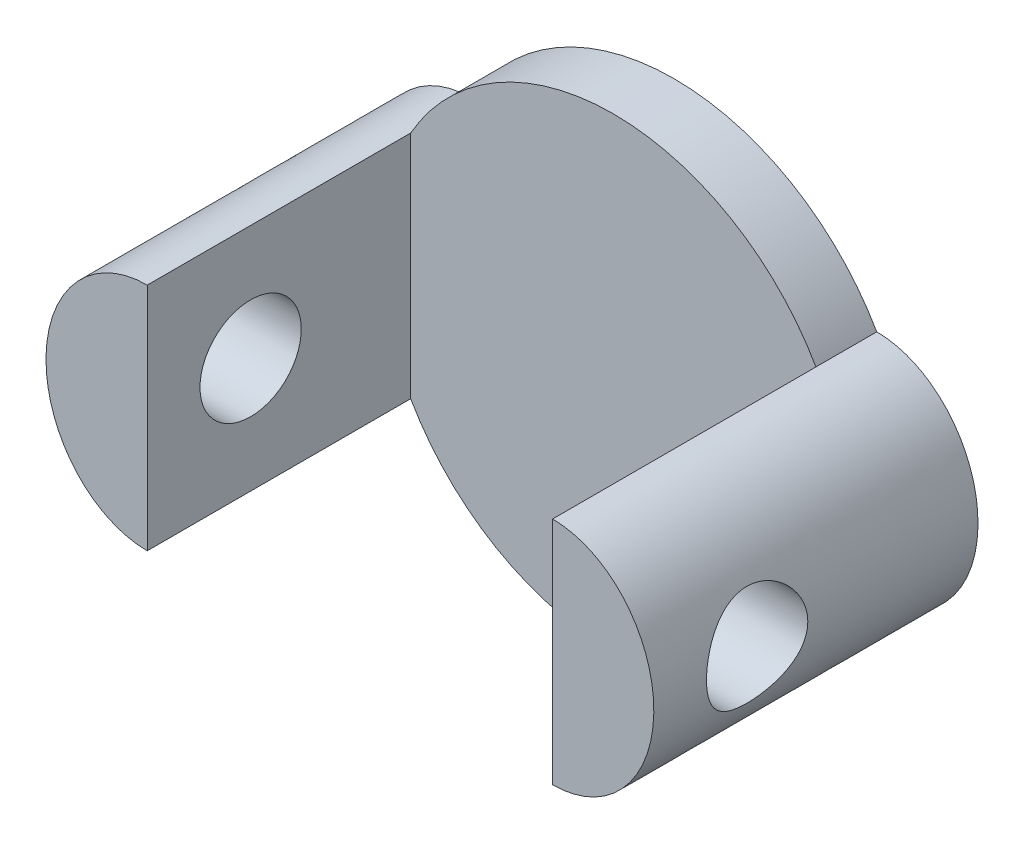
ISO-10303-21;
HEADER;
FILE_DESCRIPTION(('STEP AP214'),'2;1');
FILE_NAME('part.step','',(''),(''),'','','');
FILE_SCHEMA(('AUTOMOTIVE_DESIGN { 1 0 10303 214 1 1 1 1 }'));
ENDSEC;
DATA;
#1=APPLICATION_CONTEXT('core data for automotive mechanical design processes');
#2=APPLICATION_PROTOCOL_DEFINITION('international standard','automotive_design',2000,#1);
#3=PRODUCT_CONTEXT('',#1,'mechanical');
#4=PRODUCT('Part','Part','',(#3));
#5=PRODUCT_RELATED_PRODUCT_CATEGORY('part','',(#4));
#6=PRODUCT_DEFINITION_FORMATION('','',#4);
#7=PRODUCT_DEFINITION_CONTEXT('part definition',#1,'design');
#8=PRODUCT_DEFINITION('design','',#6,#7);
#9=PRODUCT_DEFINITION_SHAPE('','',#8);
#10=(LENGTH_UNIT() NAMED_UNIT(*) SI_UNIT(.MILLI.,.METRE.));
#11=(NAMED_UNIT(*) PLANE_ANGLE_UNIT() SI_UNIT($,.RADIAN.));
#12=(NAMED_UNIT(*) SI_UNIT($,.STERADIAN.) SOLID_ANGLE_UNIT());
#13=UNCERTAINTY_MEASURE_WITH_UNIT(LENGTH_MEASURE(1.E-05),#10,'distance_accuracy_value','');
#14=(GEOMETRIC_REPRESENTATION_CONTEXT(3) GLOBAL_UNCERTAINTY_ASSIGNED_CONTEXT((#13)) GLOBAL_UNIT_ASSIGNED_CONTEXT((#10,
#11,#12)) REPRESENTATION_CONTEXT('',''));
#15=CARTESIAN_POINT('',(0.,0.,0.));
#16=DIRECTION('',(0.,0.,1.));
#17=DIRECTION('',(1.,0.,0.));
#18=AXIS2_PLACEMENT_3D('',#15,#16,#17);
#19=CARTESIAN_POINT('',(0.,0.,160.));
#20=DIRECTION('',(0.,0.,-1.));
#21=DIRECTION('',(-1.,0.,0.));
#22=AXIS2_PLACEMENT_3D('',#19,#20,#21);
#23=CYLINDRICAL_SURFACE('',#22,115.);
#24=CARTESIAN_POINT('',(0.,0.,30.));
#25=DIRECTION('',(0.,0.,1.));
#26=DIRECTION('',(1.,0.,0.));
#27=AXIS2_PLACEMENT_3D('',#24,#25,#26);
#28=CIRCLE('',#27,115.);
#29=CARTESIAN_POINT('',(99.9999999999997,56.789083458004,30.));
#30=VERTEX_POINT('',#29);
#31=CARTESIAN_POINT('',(-100.,56.7890834580027,30.));
#32=VERTEX_POINT('',#31);
#33=EDGE_CURVE('E209',#30,#32,#28,.T.);
#34=ORIENTED_EDGE('',*,*,#33,.F.);
#35=DIRECTION('',(0.,0.,-1.));
#36=VECTOR('',#35,1.);
#37=CARTESIAN_POINT('',(99.9999999999997,56.789083458004,160.));
#38=LINE('',#37,#36);
#39=CARTESIAN_POINT('',(99.9999999999997,56.789083458004,0.));
#40=VERTEX_POINT('',#39);
#41=EDGE_CURVE('E126',#30,#40,#38,.T.);
#42=ORIENTED_EDGE('',*,*,#41,.T.);
#43=CARTESIAN_POINT('',(0.,0.,0.));
#44=DIRECTION('',(0.,0.,1.));
#45=DIRECTION('',(1.,0.,0.));
#46=AXIS2_PLACEMENT_3D('',#43,#44,#45);
#47=CIRCLE('',#46,115.);
#48=CARTESIAN_POINT('',(-100.,56.7890834580029,0.));
#49=VERTEX_POINT('',#48);
#50=EDGE_CURVE('E105',#40,#49,#47,.T.);
#51=ORIENTED_EDGE('',*,*,#50,.T.);
#52=DIRECTION('',(0.,0.,-1.));
#53=VECTOR('',#52,1.);
#54=CARTESIAN_POINT('',(-100.,56.7890834580029,160.));
#55=LINE('',#54,#53);
#56=EDGE_CURVE('E100',#32,#49,#55,.T.);
#57=ORIENTED_EDGE('',*,*,#56,.F.);
#58=EDGE_LOOP('',(#34,#42,#51,#57));
#59=FACE_BOUND('',#58,.T.);
#60=ADVANCED_FACE('F45',(#59),#23,.T.);
#61=CARTESIAN_POINT('',(0.,0.,160.));
#62=DIRECTION('',(0.,0.,-1.));
#63=DIRECTION('',(-1.,0.,0.));
#64=AXIS2_PLACEMENT_3D('',#61,#62,#63);
#65=CYLINDRICAL_SURFACE('',#64,115.);
#66=CARTESIAN_POINT('',(0.,0.,30.));
#67=DIRECTION('',(0.,0.,1.));
#68=DIRECTION('',(1.,0.,0.));
#69=AXIS2_PLACEMENT_3D('',#66,#67,#68);
#70=CIRCLE('',#69,115.);
#71=CARTESIAN_POINT('',(-100.,-56.7890834580029,30.));
#72=VERTEX_POINT('',#71);
#73=CARTESIAN_POINT('',(99.9999999999997,-56.7890834580039,30.));
#74=VERTEX_POINT('',#73);
#75=EDGE_CURVE('E11',#72,#74,#70,.T.);
#76=ORIENTED_EDGE('',*,*,#75,.F.);
#77=DIRECTION('',(0.,0.,-1.));
#78=VECTOR('',#77,1.);
#79=CARTESIAN_POINT('',(-100.,-56.7890834580027,160.));
#80=LINE('',#79,#78);
#81=CARTESIAN_POINT('',(-100.,-56.7890834580027,0.));
#82=VERTEX_POINT('',#81);
#83=EDGE_CURVE('E83',#72,#82,#80,.T.);
#84=ORIENTED_EDGE('',*,*,#83,.T.);
#85=CARTESIAN_POINT('',(0.,0.,0.));
#86=DIRECTION('',(0.,0.,1.));
#87=DIRECTION('',(1.,0.,0.));
#88=AXIS2_PLACEMENT_3D('',#85,#86,#87);
#89=CIRCLE('',#88,115.);
#90=CARTESIAN_POINT('',(100.000000000001,-56.7890834580012,0.));
#91=VERTEX_POINT('',#90);
#92=EDGE_CURVE('E88',#82,#91,#89,.T.);
#93=ORIENTED_EDGE('',*,*,#92,.T.);
#94=DIRECTION('',(0.,0.,-1.));
#95=VECTOR('',#94,1.);
#96=CARTESIAN_POINT('',(100.000000000001,-56.7890834580012,160.));
#97=LINE('',#96,#95);
#98=EDGE_CURVE('E119',#74,#91,#97,.T.);
#99=ORIENTED_EDGE('',*,*,#98,.F.);
#100=EDGE_LOOP('',(#76,#84,#93,#99));
#101=FACE_BOUND('',#100,.T.);
#102=ADVANCED_FACE('F85',(#101),#65,.T.);
#103=CARTESIAN_POINT('',(100.000000000001,1.38777878078145E-12,160.));
#104=DIRECTION('',(0.,0.,-1.));
#105=DIRECTION('',(-1.,0.,0.));
#106=AXIS2_PLACEMENT_3D('',#103,#104,#105);
#107=PLANE('',#106);
#108=CARTESIAN_POINT('',(-100.,0.,160.));
#109=DIRECTION('',(0.,0.,1.));
#110=DIRECTION('',(0.,1.,0.));
#111=AXIS2_PLACEMENT_3D('',#108,#109,#110);
#112=ELLIPSE('',#111,56.7890834580027,50.);
#113=CARTESIAN_POINT('',(-100.,56.7890834580027,160.));
#114=VERTEX_POINT('',#113);
#115=CARTESIAN_POINT('',(-100.,-56.7890834580029,160.));
#116=VERTEX_POINT('',#115);
#117=EDGE_CURVE('E115',#114,#116,#112,.T.);
#118=ORIENTED_EDGE('',*,*,#117,.T.);
#119=DIRECTION('',(0.,1.,0.));
#120=VECTOR('',#119,1.);
#121=CARTESIAN_POINT('',(-100.,1.35409814467722E-12,160.));
#122=LINE('',#121,#120);
#123=EDGE_CURVE('E58',#116,#114,#122,.T.);
#124=ORIENTED_EDGE('',*,*,#123,.T.);
#125=EDGE_LOOP('',(#118,#124));
#126=FACE_BOUND('',#125,.T.);
#127=ADVANCED_FACE('F141',(#126),#107,.F.);
#128=CARTESIAN_POINT('',(100.000000000001,1.38777878078145E-12,160.));
#129=DIRECTION('',(0.,0.,1.));
#130=DIRECTION('',(0.,1.,0.));
#131=AXIS2_PLACEMENT_3D('',#128,#129,#130);
#132=ELLIPSE('',#131,56.7890834580027,50.);
#133=DIRECTION('',(0.,0.,-1.));
#134=VECTOR('',#133,1.);
#135=SURFACE_OF_LINEAR_EXTRUSION('',#132,#134);
#136=CARTESIAN_POINT('',(144.894363521149,25.,109.));
#137=CARTESIAN_POINT('',(144.894368556172,24.9999950347854,108.329231197904));
#138=CARTESIAN_POINT('',(144.906057373851,24.9729668299235,107.658240525224));
#139=CARTESIAN_POINT('',(144.952426065453,24.8651140989651,106.321101595667));
#140=CARTESIAN_POINT('',(144.987120453288,24.7842556119221,105.654956664293));
#141=CARTESIAN_POINT('',(145.078409591069,24.5693499723057,104.33120418165));
#142=CARTESIAN_POINT('',(145.135055499316,24.4351785545981,103.673620309788));
#143=CARTESIAN_POINT('',(145.268321221031,24.1150637319087,102.373389524043));
#144=CARTESIAN_POINT('',(145.344938045947,23.9291280729128,101.730740390905));
#145=CARTESIAN_POINT('',(145.515356580168,23.5080393304398,100.466881471337));
#146=CARTESIAN_POINT('',(145.609092606083,23.2730738905481,99.8456001724598));
#147=CARTESIAN_POINT('',(145.811103575888,22.7554886741812,98.625666427075));
#148=CARTESIAN_POINT('',(145.919379029678,22.4728672263112,98.0270147751372));
#149=CARTESIAN_POINT('',(146.14732647972,21.8622321906428,96.8559144828546));
#150=CARTESIAN_POINT('',(146.266994534747,21.534234282975,96.2834568815306));
#151=CARTESIAN_POINT('',(146.514553173208,20.8349040416154,95.1674166239178));
#152=CARTESIAN_POINT('',(146.642444204257,20.4635693479937,94.6238355424644));
#153=CARTESIAN_POINT('',(146.84128977608,19.8658298939089,93.8188201238916));
#154=CARTESIAN_POINT('',(146.910480302842,19.6542158712316,93.5458426383577));
#155=CARTESIAN_POINT('',(147.049731523938,19.2200350613653,93.009084386135));
#156=CARTESIAN_POINT('',(147.119792009563,18.9974708646309,92.7453014692978));
#157=CARTESIAN_POINT('',(147.330611220712,18.3137162862773,91.9681512907157));
#158=CARTESIAN_POINT('',(147.472015726562,17.8364400427016,91.4689504628656));
#159=CARTESIAN_POINT('',(147.752802420339,16.8418221904528,90.5113586915465));
#160=CARTESIAN_POINT('',(147.892183956519,16.324467995616,90.052980666098));
#161=CARTESIAN_POINT('',(148.165314185362,15.2526533967951,89.1799533555816));
#162=CARTESIAN_POINT('',(148.29906280386,14.6981925045056,88.7653046461544));
#163=CARTESIAN_POINT('',(148.562263448946,13.5342383382462,87.9681168881713));
#164=CARTESIAN_POINT('',(148.69137546775,12.9234699777699,87.5873243987379));
#165=CARTESIAN_POINT('',(148.936284340394,11.6692861120943,86.8788227060358));
#166=CARTESIAN_POINT('',(149.052080768537,11.0258695640871,86.5511151997452));
#167=CARTESIAN_POINT('',(149.267064757994,9.71095405139172,85.9518063621348));
#168=CARTESIAN_POINT('',(149.366257276167,9.03946354286427,85.6801882804459));
#169=CARTESIAN_POINT('',(149.545218486804,7.67312905983944,85.1956220871929));
#170=CARTESIAN_POINT('',(149.624988354256,6.97828650093734,84.9826704264575));
#171=CARTESIAN_POINT('',(149.759530719128,5.60370474194978,84.6262698939044));
#172=CARTESIAN_POINT('',(149.815300458868,4.92478651575991,84.480028823639));
#173=CARTESIAN_POINT('',(149.905552168596,3.55575008993984,84.2444143668963));
#174=CARTESIAN_POINT('',(149.940034747544,2.86563221127669,84.155039353655));
#175=CARTESIAN_POINT('',(149.986749327729,1.47980142410124,84.0341464936305));
#176=CARTESIAN_POINT('',(149.99898790908,0.784090231362905,84.0026115368542));
#177=CARTESIAN_POINT('',(150.000891301508,-0.607557928949882,83.9977001006275));
#178=CARTESIAN_POINT('',(149.990556840115,-1.30349488852504,84.0243217467857));
#179=CARTESIAN_POINT('',(149.948737937048,-2.65358808368269,84.1324959696746));
#180=CARTESIAN_POINT('',(149.918392638926,-3.30801922950008,84.2110905561345));
#181=CARTESIAN_POINT('',(149.838463407718,-4.60746410896543,84.4194338185319));
#182=CARTESIAN_POINT('',(149.788880277919,-5.25247823465947,84.5491803585955));
#183=CARTESIAN_POINT('',(149.67169132969,-6.52874229560619,84.8586099487053));
#184=CARTESIAN_POINT('',(149.604084982378,-7.15999182635598,85.0382944641617));
#185=CARTESIAN_POINT('',(149.452479634725,-8.4046520203995,85.4460043211301));
#186=CARTESIAN_POINT('',(149.368480197689,-9.01806220797141,85.6740309504398));
#187=CARTESIAN_POINT('',(149.184766402354,-10.2319341888613,86.1801379678215));
#188=CARTESIAN_POINT('',(149.084844449865,-10.8320852742545,86.4588876519898));
#189=CARTESIAN_POINT('',(148.872552983732,-12.0066820210371,87.0620081705216));
#190=CARTESIAN_POINT('',(148.760183434398,-12.5811276087114,87.386379135701));
#191=CARTESIAN_POINT('',(148.525589629462,-13.7013205956684,88.0785422067058));
#192=CARTESIAN_POINT('',(148.403362793114,-14.2470604172683,88.4463456954259));
#193=CARTESIAN_POINT('',(148.151909664892,-15.3068289229021,89.2229262566299));
#194=CARTESIAN_POINT('',(148.022683092269,-15.8208563332294,89.6317049731263));
#195=CARTESIAN_POINT('',(147.75205629676,-16.8454583033008,90.5144508274207));
#196=CARTESIAN_POINT('',(147.610397867403,-17.3538461340511,90.9908875952597));
#197=CARTESIAN_POINT('',(147.397346670347,-18.0850793688688,91.7358442880612));
#198=CARTESIAN_POINT('',(147.326231250762,-18.3236128511314,91.9892300986436));
#199=CARTESIAN_POINT('',(147.184258022777,-18.7899960852633,92.5058444169005));
#200=CARTESIAN_POINT('',(147.113400283735,-19.0178431324434,92.7690753863629));
#201=CARTESIAN_POINT('',(146.901941355322,-19.6848030109755,93.572966198372));
#202=CARTESIAN_POINT('',(146.762453969659,-20.1073362264721,94.1278256227224));
#203=CARTESIAN_POINT('',(146.49041563923,-20.9052713419556,95.2720691250259));
#204=CARTESIAN_POINT('',(146.357864537178,-21.2806743109369,95.8614524194738));
#205=CARTESIAN_POINT('',(146.165434209211,-21.8112102370442,96.7770635000922));
#206=CARTESIAN_POINT('',(146.101552330749,-21.984705555232,97.0919316621116));
#207=CARTESIAN_POINT('',(145.977177356129,-22.3181693587649,97.7293005890983));
#208=CARTESIAN_POINT('',(145.916683448837,-22.4781410865842,98.0517995006144));
#209=CARTESIAN_POINT('',(145.741015203128,-22.9373354394864,99.0301698514212));
#210=CARTESIAN_POINT('',(145.63164231665,-23.2158700010922,99.6969714160684));
#211=CARTESIAN_POINT('',(145.432341338689,-23.7147451256155,101.054336928578));
#212=CARTESIAN_POINT('',(145.342402990474,-23.9351163983323,101.744888118224));
#213=CARTESIAN_POINT('',(145.185232071654,-24.3155209469368,103.144963301135));
#214=CARTESIAN_POINT('',(145.117997722655,-24.4755589488199,103.854485803684));
#215=CARTESIAN_POINT('',(145.012110245192,-24.7257333871125,105.244127308767));
#216=CARTESIAN_POINT('',(144.971997306614,-24.8194556062135,105.923491259489));
#217=CARTESIAN_POINT('',(144.915632820245,-24.9507764182586,107.2886068789));
#218=CARTESIAN_POINT('',(144.899380318599,-24.9883772547336,107.974358291139));
#219=CARTESIAN_POINT('',(144.891337193415,-25.0070114605971,109.346592947165));
#220=CARTESIAN_POINT('',(144.899540321217,-24.9880592798481,110.033075959216));
#221=CARTESIAN_POINT('',(144.940092212524,-24.8938427478276,111.401432754232));
#222=CARTESIAN_POINT('',(144.972440395832,-24.8185797496824,112.083306647555));
#223=CARTESIAN_POINT('',(145.05764965882,-24.6183697553633,113.399304697292));
#224=CARTESIAN_POINT('',(145.109265625215,-24.4964289217547,114.033970445812));
#225=CARTESIAN_POINT('',(145.231334926612,-24.2043195387485,115.290211616834));
#226=CARTESIAN_POINT('',(145.301787414782,-24.0341531573996,115.911787626455));
#227=CARTESIAN_POINT('',(145.45941990782,-23.6470820035451,117.138123122461));
#228=CARTESIAN_POINT('',(145.546602764242,-23.4301692627293,117.742879721968));
#229=CARTESIAN_POINT('',(145.735191820885,-22.9513769678846,118.932027754678));
#230=CARTESIAN_POINT('',(145.83659865169,-22.6894954201643,119.51641828357));
#231=CARTESIAN_POINT('',(146.055306582142,-22.1109784520989,120.685343701651));
#232=CARTESIAN_POINT('',(146.173090623464,-21.7925306888978,121.268891105897));
#233=CARTESIAN_POINT('',(146.417831185053,-21.1111794800121,122.407394718633));
#234=CARTESIAN_POINT('',(146.544787877242,-20.7482752009916,122.962350390895));
#235=CARTESIAN_POINT('',(146.80457242708,-19.9801797256228,124.040976304064));
#236=CARTESIAN_POINT('',(146.937402220097,-19.5749745290451,124.564636096305));
#237=CARTESIAN_POINT('',(147.20557551058,-18.724616457988,125.577879832282));
#238=CARTESIAN_POINT('',(147.340919099101,-18.2794621342127,126.067462538606));
#239=CARTESIAN_POINT('',(147.548149309578,-17.5670825378241,126.791098749934));
#240=CARTESIAN_POINT('',(147.620335094868,-17.3131605944574,127.038293615381));
#241=CARTESIAN_POINT('',(147.763970550649,-16.794993344307,127.521709597034));
#242=CARTESIAN_POINT('',(147.835420383245,-16.5307503751366,127.757933171902));
#243=CARTESIAN_POINT('',(148.047976295613,-15.7229546917371,128.44971016741));
#244=CARTESIAN_POINT('',(148.18729704887,-15.1643071048573,128.888398400518));
#245=CARTESIAN_POINT('',(148.457336872933,-14.0103566811006,129.717500099457));
#246=CARTESIAN_POINT('',(148.58805551251,-13.4150520094718,130.107911145982));
#247=CARTESIAN_POINT('',(148.837368290663,-12.1913918639603,130.837519718806));
#248=CARTESIAN_POINT('',(148.955962722369,-11.5630371896927,131.176718483372));
#249=CARTESIAN_POINT('',(149.177482027536,-10.2790520163404,131.800199403595));
#250=CARTESIAN_POINT('',(149.280446968015,-9.62349694158629,132.084622500957));
#251=CARTESIAN_POINT('',(149.468211960496,-8.28812063386326,132.597000819472));
#252=CARTESIAN_POINT('',(149.553011891152,-7.6082992388231,132.824955663401));
#253=CARTESIAN_POINT('',(149.701997133249,-6.22975361962117,133.221982773767));
#254=CARTESIAN_POINT('',(149.766190921207,-5.53103729662955,133.391079254523));
#255=CARTESIAN_POINT('',(149.872137437533,-4.12000115724839,133.668654303384));
#256=CARTESIAN_POINT('',(149.91389156756,-3.40768219340584,133.777136657673));
#257=CARTESIAN_POINT('',(149.971871381844,-2.01986689176782,133.927427541913));
#258=CARTESIAN_POINT('',(149.989521252703,-1.34483058657404,133.972957879292));
#259=CARTESIAN_POINT('',(150.003540479809,0.00691769003103627,134.009138806279));
#260=CARTESIAN_POINT('',(149.999910771684,0.683629586461526,133.999791808756));
#261=CARTESIAN_POINT('',(149.97146910118,2.03352630633315,133.92632424142));
#262=CARTESIAN_POINT('',(149.946659929413,2.70671158268598,133.862210887635));
#263=CARTESIAN_POINT('',(149.876514994706,4.04462421179346,133.679887018996));
#264=CARTESIAN_POINT('',(149.831179284175,4.70935158613869,133.561676642265));
#265=CARTESIAN_POINT('',(149.722688041088,6.00726200992695,133.276367337055));
#266=CARTESIAN_POINT('',(149.660061788486,6.64080856730083,133.110715736884));
#267=CARTESIAN_POINT('',(149.518033552974,7.89122404098399,132.730898243747));
#268=CARTESIAN_POINT('',(149.438632002327,8.50809338656703,132.516733600846));
#269=CARTESIAN_POINT('',(149.264916017883,9.72145390959457,132.041655604414));
#270=CARTESIAN_POINT('',(149.170599787055,10.3179426208836,131.780736617067));
#271=CARTESIAN_POINT('',(148.969239827072,11.4870505198662,131.21417725256));
#272=CARTESIAN_POINT('',(148.862195623342,12.0596688164539,130.908535207762));
#273=CARTESIAN_POINT('',(148.633082870686,13.2014821532325,130.240914317686));
#274=CARTESIAN_POINT('',(148.510571577564,13.7695186281451,129.87710569365));
#275=CARTESIAN_POINT('',(148.25734156834,14.873151833139,129.10578621076));
#276=CARTESIAN_POINT('',(148.126622654538,15.4087477812058,128.698274299047));
#277=CARTESIAN_POINT('',(147.860125023405,16.4446995767134,127.842066792108));
#278=CARTESIAN_POINT('',(147.72434569208,16.945051126432,127.39336618962));
#279=CARTESIAN_POINT('',(147.450988690736,17.908010224188,126.457214204794));
#280=CARTESIAN_POINT('',(147.313410204171,18.3705998917857,125.969744678387));
#281=CARTESIAN_POINT('',(147.031923200394,19.281181720004,124.929265697499));
#282=CARTESIAN_POINT('',(146.888115654768,19.7267336609006,124.374090008836));
#283=CARTESIAN_POINT('',(146.606591438621,20.5693489242304,123.227020247196));
#284=CARTESIAN_POINT('',(146.468872106163,20.9664335743592,122.635142498877));
#285=CARTESIAN_POINT('',(146.203544478168,21.7096948090885,121.417651330299));
#286=CARTESIAN_POINT('',(146.075941144443,22.0558464818804,120.79202160472));
#287=CARTESIAN_POINT('',(145.835015368715,22.6941829477941,119.5112262771));
#288=CARTESIAN_POINT('',(145.721690961253,22.986375170889,118.856064756933));
#289=CARTESIAN_POINT('',(145.522343612803,23.4909245029176,117.579352189304));
#290=CARTESIAN_POINT('',(145.434795590667,23.7080448917775,116.959918505523));
#291=CARTESIAN_POINT('',(145.277383277137,24.093396305503,115.703717450413));
#292=CARTESIAN_POINT('',(145.207520602473,24.2616228608827,115.066948500246));
#293=CARTESIAN_POINT('',(145.087856693687,24.5471964471682,113.781975879325));
#294=CARTESIAN_POINT('',(145.038004850708,24.6646718895305,113.133805438022));
#295=CARTESIAN_POINT('',(144.959770631849,24.8481196553644,111.82920209083));
#296=CARTESIAN_POINT('',(144.931375404978,24.9141228078461,111.172774370382));
#297=CARTESIAN_POINT('',(144.907574585225,24.969376192375,110.262585729976));
#298=CARTESIAN_POINT('',(144.90262401301,24.9808565900471,110.01024921339));
#299=CARTESIAN_POINT('',(144.896017427479,24.9961696732379,109.505285635915));
#300=CARTESIAN_POINT('',(144.894361624607,25.000001870248,109.252658557498));
#301=CARTESIAN_POINT('',(144.894363521149,25.,109.));
#302=B_SPLINE_CURVE_WITH_KNOTS('',3,(#136,#137,#138,#139,#140,#141,#142,#143,#144,#145,#146,
#147,#148,#149,#150,#151,#152,#153,#154,#155,#156,#157,#158,#159,#160,#161,#162,#163,#164,#165,
#166,#167,#168,#169,#170,#171,#172,#173,#174,#175,#176,#177,#178,#179,#180,#181,#182,#183,#184,
#185,#186,#187,#188,#189,#190,#191,#192,#193,#194,#195,#196,#197,#198,#199,#200,#201,#202,#203,
#204,#205,#206,#207,#208,#209,#210,#211,#212,#213,#214,#215,#216,#217,#218,#219,#220,#221,#222,
#223,#224,#225,#226,#227,#228,#229,#230,#231,#232,#233,#234,#235,#236,#237,#238,#239,#240,#241,
#242,#243,#244,#245,#246,#247,#248,#249,#250,#251,#252,#253,#254,#255,#256,#257,#258,#259,#260,
#261,#262,#263,#264,#265,#266,#267,#268,#269,#270,#271,#272,#273,#274,#275,#276,#277,#278,#279,
#280,#281,#282,#283,#284,#285,#286,#287,#288,#289,#290,#291,#292,#293,#294,#295,#296,#297,#298,
#299,#300,#301),.UNSPECIFIED.,.T.,.F.,(4,2,2,2,2,2,2,2,2,2,2,2,2,2,2,2,2,2,2,2,2,2,2,2,2,2,2,2,
2,2,2,2,2,2,2,2,2,2,2,2,2,2,2,2,2,2,2,2,2,2,2,2,2,2,2,2,2,2,2,2,2,2,2,2,2,2,2,2,2,2,2,2,2,2,2,2,
2,2,2,2,2,2,4),(0.,2.01204912432499,4.02536883327427,6.04340910428527,8.06114755850334,
10.071301014923,12.0815249862479,14.0910560386846,16.1006965724129,17.1572094793595,
18.2134736403873,20.3258798320831,22.438952118681,24.5520522177123,26.7430287311236,
28.9340752701027,31.1244665325373,33.3147252526752,35.4022197858076,37.4896545994181,
39.5764718175227,41.6632217783577,43.6403905978758,45.6174768685173,47.5946211620968,
49.5718181319345,51.577296127198,53.5827798731544,55.5887903922879,57.5948814290293,
59.725252471251,60.7905701526378,61.8561560220475,63.9873205800542,66.1184367908743,
67.2135331882096,68.3083662714045,70.4978338671205,72.6861431165169,74.8742809167399,
76.9325163612895,78.9906695227905,81.0482968505674,83.1058747359692,85.0486591318122,
86.9913562008556,88.9343846812541,90.8774993280409,92.9007295591364,94.9239977214163,
96.9479376555793,98.9719510450262,100.056628924173,101.141062542772,103.309807486112,
105.478661067341,107.647462199224,109.81060602433,111.973764299462,114.136031596905,
116.298163815929,118.326039191684,120.35382540566,122.381344479252,124.408858376135,
126.380121866911,128.351334568687,130.32278495804,132.29430887777,134.348816076457,
136.403372781605,138.458179588426,140.513953779989,142.69008550538,144.865256160098,
147.041487200206,149.217418359313,151.201827246308,153.186417475195,155.165956419117,
157.144308817865,157.902139177075,158.660017939144),.UNSPECIFIED.);
#303=CARTESIAN_POINT('',(144.894363521149,25.,109.));
#304=VERTEX_POINT('',#303);
#305=EDGE_CURVE('E172',#304,#304,#302,.T.);
#306=ORIENTED_EDGE('',*,*,#305,.T.);
#307=EDGE_LOOP('',(#306));
#308=FACE_BOUND('',#307,.T.);
#309=CARTESIAN_POINT('',(100.000000000001,1.38777878078145E-12,0.));
#310=DIRECTION('',(0.,0.,1.));
#311=DIRECTION('',(0.,1.,0.));
#312=AXIS2_PLACEMENT_3D('',#309,#310,#311);
#313=ELLIPSE('',#312,56.7890834580027,50.);
#314=EDGE_CURVE('E109',#91,#40,#313,.T.);
#315=ORIENTED_EDGE('',*,*,#314,.T.);
#316=ORIENTED_EDGE('',*,*,#41,.F.);
#317=CARTESIAN_POINT('',(99.9999999999997,56.789083458004,160.));
#318=VERTEX_POINT('',#317);
#319=EDGE_CURVE('E127',#318,#30,#38,.T.);
#320=ORIENTED_EDGE('',*,*,#319,.F.);
#321=CARTESIAN_POINT('',(100.000000000001,-56.7890834580012,160.));
#322=VERTEX_POINT('',#321);
#323=EDGE_CURVE('E111',#322,#318,#132,.T.);
#324=ORIENTED_EDGE('',*,*,#323,.F.);
#325=EDGE_CURVE('E65',#322,#74,#97,.T.);
#326=ORIENTED_EDGE('',*,*,#325,.T.);
#327=ORIENTED_EDGE('',*,*,#98,.T.);
#328=EDGE_LOOP('',(#315,#316,#320,#324,#326,#327));
#329=FACE_BOUND('',#328,.T.);
#330=ADVANCED_FACE('F47',(#308,#329),#135,.F.);
#331=DIRECTION('',(0.,0.,-1.));
#332=VECTOR('',#331,1.);
#333=SURFACE_OF_LINEAR_EXTRUSION('',#112,#332);
#334=CARTESIAN_POINT('',(-150.,0.,134.));
#335=CARTESIAN_POINT('',(-150.000003409936,-0.675006901797705,134.000004673457));
#336=CARTESIAN_POINT('',(-149.989382522285,-1.34995242050534,133.972641986799));
#337=CARTESIAN_POINT('',(-149.947189175687,-2.69471222568134,133.863496386157));
#338=CARTESIAN_POINT('',(-149.915619222872,-3.36452711623161,133.781719981674));
#339=CARTESIAN_POINT('',(-149.832361152553,-4.69395476352562,133.564615949124));
#340=CARTESIAN_POINT('',(-149.780678083515,-5.35357003724666,133.429301759096));
#341=CARTESIAN_POINT('',(-149.658521777601,-6.65812155757907,133.106450682091));
#342=CARTESIAN_POINT('',(-149.588047883668,-7.3030572900374,132.918911968977));
#343=CARTESIAN_POINT('',(-149.430248957606,-8.57259042666255,132.493784762114));
#344=CARTESIAN_POINT('',(-149.342958447006,-9.19722648401441,132.25629871134));
#345=CARTESIAN_POINT('',(-149.153582133931,-10.4235947711801,131.733084555576));
#346=CARTESIAN_POINT('',(-149.051496476121,-11.0253272248701,131.447356922282));
#347=CARTESIAN_POINT('',(-148.834960202492,-12.2024936504904,130.829819335951));
#348=CARTESIAN_POINT('',(-148.72050685545,-12.7779217734052,130.497999199421));
#349=CARTESIAN_POINT('',(-148.481965894248,-13.8991523885259,129.790695674804));
#350=CARTESIAN_POINT('',(-148.357877966364,-14.444953915039,129.415210864699));
#351=CARTESIAN_POINT('',(-148.097829162142,-15.5254155267094,128.60700360673));
#352=CARTESIAN_POINT('',(-147.961591558957,-16.0587466921653,128.172587497737));
#353=CARTESIAN_POINT('',(-147.754404209454,-16.8300071068905,127.489696055726));
#354=CARTESIAN_POINT('',(-147.684866082209,-17.082317444633,127.256840867114));
#355=CARTESIAN_POINT('',(-147.545262822585,-17.577126981362,126.780957512963));
#356=CARTESIAN_POINT('',(-147.475197569097,-17.8196238386182,126.537926947158));
#357=CARTESIAN_POINT('',(-147.264887073251,-18.5318647546789,125.794085163702));
#358=CARTESIAN_POINT('',(-147.124531306654,-18.9863436410404,125.278537602946));
#359=CARTESIAN_POINT('',(-146.847277067096,-19.8517305642611,124.211206632654));
#360=CARTESIAN_POINT('',(-146.710378592271,-20.2626386245917,123.659423242638));
#361=CARTESIAN_POINT('',(-146.507580558778,-20.8527016265711,122.794697758224));
#362=CARTESIAN_POINT('',(-146.439040761887,-21.0486998585853,122.493750608252));
#363=CARTESIAN_POINT('',(-146.304467557517,-21.4277376963054,121.883365470722));
#364=CARTESIAN_POINT('',(-146.238433564979,-21.6107803356435,121.573929494579));
#365=CARTESIAN_POINT('',(-146.044843642112,-22.1400410666944,120.633400074348));
#366=CARTESIAN_POINT('',(-145.921788893873,-22.4664232443636,119.990039332072));
#367=CARTESIAN_POINT('',(-145.691909262305,-23.0631286974013,118.675388317762));
#368=CARTESIAN_POINT('',(-145.585078682986,-23.3334716592717,118.004107953693));
#369=CARTESIAN_POINT('',(-145.391367237217,-23.8156461605874,116.638027991927));
#370=CARTESIAN_POINT('',(-145.304485067553,-24.0274815224754,115.943229934029));
#371=CARTESIAN_POINT('',(-145.157207131092,-24.3824365515123,114.565999536986));
#372=CARTESIAN_POINT('',(-145.095826097871,-24.5281378927642,113.884337712938));
#373=CARTESIAN_POINT('',(-144.996534904904,-24.762254383806,112.509542750019));
#374=CARTESIAN_POINT('',(-144.958624091824,-24.8506711282116,111.816409931014));
#375=CARTESIAN_POINT('',(-144.907709687084,-24.9691467009096,110.424551227709));
#376=CARTESIAN_POINT('',(-144.894695666632,-24.9992299640561,109.725827808422));
#377=CARTESIAN_POINT('',(-144.894044033779,-25.0007407140138,108.328321959953));
#378=CARTESIAN_POINT('',(-144.906405260637,-24.9721708837968,107.629539534932));
#379=CARTESIAN_POINT('',(-144.954317750575,-24.8607011241319,106.285470390836));
#380=CARTESIAN_POINT('',(-144.988221252909,-24.7816597687393,105.639800186415));
#381=CARTESIAN_POINT('',(-145.076508072847,-24.5738307629978,104.357977973711));
#382=CARTESIAN_POINT('',(-145.130890318741,-24.4450457158718,103.72182546915));
#383=CARTESIAN_POINT('',(-145.258425128774,-24.1389581564209,102.463160025769));
#384=CARTESIAN_POINT('',(-145.331580230215,-23.9616490854727,101.84064894305));
#385=CARTESIAN_POINT('',(-145.494445345293,-23.5601003649874,100.613183388662));
#386=CARTESIAN_POINT('',(-145.584155964455,-23.3358589988458,100.008229560093));
#387=CARTESIAN_POINT('',(-145.779568442246,-22.8371217618731,98.806984078633));
#388=CARTESIAN_POINT('',(-145.885564113108,-22.5616775902447,98.2111343451362));
#389=CARTESIAN_POINT('',(-146.109127229444,-21.9658422888167,97.0446362016595));
#390=CARTESIAN_POINT('',(-146.226694732774,-21.6454509342911,96.4739879177));
#391=CARTESIAN_POINT('',(-146.470294432228,-20.9617782371577,95.3606910943284));
#392=CARTESIAN_POINT('',(-146.596329122038,-20.598484235137,94.8180508875612));
#393=CARTESIAN_POINT('',(-146.853658703099,-19.8311918751839,93.7635655809255));
#394=CARTESIAN_POINT('',(-146.984953853072,-19.4271915137373,93.2517219988093));
#395=CARTESIAN_POINT('',(-147.188431826777,-18.7764039326746,92.4903219122118));
#396=CARTESIAN_POINT('',(-147.259901370743,-18.543212264326,92.22883537523));
#397=CARTESIAN_POINT('',(-147.402930239115,-18.0661215450381,91.7159641696598));
#398=CARTESIAN_POINT('',(-147.474489539769,-17.8222249091394,91.4645772468609));
#399=CARTESIAN_POINT('',(-147.688617109122,-17.07486199508,90.7259848170923));
#400=CARTESIAN_POINT('',(-147.830642499368,-16.5556991186776,90.254320052753));
#401=CARTESIAN_POINT('',(-148.10941178448,-15.4786998830662,89.3556124732675));
#402=CARTESIAN_POINT('',(-148.246154730361,-14.9208566248157,88.928577652559));
#403=CARTESIAN_POINT('',(-148.510749189851,-13.7697514459612,88.1220754841472));
#404=CARTESIAN_POINT('',(-148.638600764128,-13.1764897670752,87.7426078118699));
#405=CARTESIAN_POINT('',(-148.884109625919,-11.9476848153716,87.0280503364115));
#406=CARTESIAN_POINT('',(-149.001554490998,-11.3115909252974,86.6938331700985));
#407=CARTESIAN_POINT('',(-149.220471787831,-10.0106810982753,86.0805024815311));
#408=CARTESIAN_POINT('',(-149.321943893628,-9.34586457553462,85.8013900837754));
#409=CARTESIAN_POINT('',(-149.505994810936,-7.99252363161995,85.3010588664006));
#410=CARTESIAN_POINT('',(-149.588580825614,-7.30400836482196,85.0798179699102));
#411=CARTESIAN_POINT('',(-149.732503042029,-5.9083255013264,84.6974256403776));
#412=CARTESIAN_POINT('',(-149.793840620693,-5.20115911644251,84.5362703136609));
#413=CARTESIAN_POINT('',(-149.89061807667,-3.81454170441941,84.2832576017645));
#414=CARTESIAN_POINT('',(-149.927332550148,-3.13580209866422,84.187979988207));
#415=CARTESIAN_POINT('',(-149.97926598287,-1.77197996067897,84.0534662218934));
#416=CARTESIAN_POINT('',(-149.994485757927,-1.08689767017341,84.0142279422125));
#417=CARTESIAN_POINT('',(-150.003016592415,0.284161365498862,83.9922163286939));
#418=CARTESIAN_POINT('',(-149.996332278986,0.970137891160572,84.0094310694085));
#419=CARTESIAN_POINT('',(-149.961246274509,2.33779374992587,84.1001130471393));
#420=CARTESIAN_POINT('',(-149.932844955403,3.01947315642358,84.1735793207488));
#421=CARTESIAN_POINT('',(-149.856711366479,4.34518046109736,84.3717679192391));
#422=CARTESIAN_POINT('',(-149.809830848379,4.98959634767076,84.4942349958537));
#423=CARTESIAN_POINT('',(-149.697978116603,6.26530400443769,84.78895868369));
#424=CARTESIAN_POINT('',(-149.633006534805,6.89659623218183,84.9612135559508));
#425=CARTESIAN_POINT('',(-149.486526165403,8.14203821766307,85.353993544321));
#426=CARTESIAN_POINT('',(-149.405016184908,8.75618673521219,85.5745221424348));
#427=CARTESIAN_POINT('',(-149.227377948875,9.96357734983243,86.0620177558567));
#428=CARTESIAN_POINT('',(-149.131249208015,10.5568187520147,86.3289863129403));
#429=CARTESIAN_POINT('',(-148.923606810243,11.7359294162264,86.9157487816037));
#430=CARTESIAN_POINT('',(-148.811726705464,12.3210811458114,87.2368544091059));
#431=CARTESIAN_POINT('',(-148.577507844829,13.4623383691732,87.9237329185089));
#432=CARTESIAN_POINT('',(-148.455168950485,14.0184434781788,88.2895063918962));
#433=CARTESIAN_POINT('',(-148.20289182474,15.0987830471724,89.0633889196138));
#434=CARTESIAN_POINT('',(-148.072951150369,15.6230071500059,89.4715116165983));
#435=CARTESIAN_POINT('',(-147.808549329513,16.6367486891092,90.3275963363033));
#436=CARTESIAN_POINT('',(-147.674087994365,17.1262646742256,90.7755600230204));
#437=CARTESIAN_POINT('',(-147.467218590663,17.8472066439117,91.4899655253326));
#438=CARTESIAN_POINT('',(-147.395258217317,18.0920826567405,91.7431018247361));
#439=CARTESIAN_POINT('',(-147.251480609152,18.5708868094782,92.2594472425376));
#440=CARTESIAN_POINT('',(-147.179663345249,18.8048174515181,92.5226540335478));
#441=CARTESIAN_POINT('',(-146.96512777642,19.4897885164493,93.3269648095128));
#442=CARTESIAN_POINT('',(-146.823317574837,19.9240360707538,93.8827869400956));
#443=CARTESIAN_POINT('',(-146.546210490878,20.7447392389793,95.0302621218941));
#444=CARTESIAN_POINT('',(-146.410914810596,21.1311860529381,95.6219217408985));
#445=CARTESIAN_POINT('',(-146.150885422743,21.8535082865324,96.83759955285));
#446=CARTESIAN_POINT('',(-146.02615159275,22.1893842923649,97.4616173706009));
#447=CARTESIAN_POINT('',(-145.790116206139,22.8106950351768,98.744050735787));
#448=CARTESIAN_POINT('',(-145.678948678024,23.0956376651389,99.402729771153));
#449=CARTESIAN_POINT('',(-145.475207192344,23.6086087067875,100.744725008929));
#450=CARTESIAN_POINT('',(-145.382633470183,23.8366363979231,101.428041523128));
#451=CARTESIAN_POINT('',(-145.219510480569,24.2332549039867,102.813849942154));
#452=CARTESIAN_POINT('',(-145.148947674078,24.4018822646777,103.516329769164));
#453=CARTESIAN_POINT('',(-145.032492796329,24.6779206610353,104.935217749277));
#454=CARTESIAN_POINT('',(-144.986598710758,24.7853366949302,105.65162476021));
#455=CARTESIAN_POINT('',(-144.923609551392,24.9322586647523,107.041464346179));
#456=CARTESIAN_POINT('',(-144.90471343651,24.976015579682,107.714368972749));
#457=CARTESIAN_POINT('',(-144.89047941176,25.0090032796654,109.061748011346));
#458=CARTESIAN_POINT('',(-144.89514034984,24.9982367311774,109.736222344996));
#459=CARTESIAN_POINT('',(-144.927852135322,24.9223074075851,111.08144919155));
#460=CARTESIAN_POINT('',(-144.955900627808,24.8571501091398,111.752202072328));
#461=CARTESIAN_POINT('',(-145.034395449723,24.6731752419945,113.084966245839));
#462=CARTESIAN_POINT('',(-145.084841708037,24.554357843674,113.746977566322));
#463=CARTESIAN_POINT('',(-145.204090004611,24.2698411788299,115.032550911));
#464=CARTESIAN_POINT('',(-145.272122245277,24.1060935683433,115.656618366537));
#465=CARTESIAN_POINT('',(-145.425238864742,23.731605029294,116.888298026519));
#466=CARTESIAN_POINT('',(-145.510322668314,23.5208656859494,117.495910785273));
#467=CARTESIAN_POINT('',(-145.695105070696,23.054076468534,118.691303496377));
#468=CARTESIAN_POINT('',(-145.79480665837,22.7980173258068,119.279079362417));
#469=CARTESIAN_POINT('',(-146.006082324449,22.2425182919397,120.431520612622));
#470=CARTESIAN_POINT('',(-146.117656982193,21.9430762836997,120.996184867206));
#471=CARTESIAN_POINT('',(-146.356528999035,21.2842015248509,122.131564738605));
#472=CARTESIAN_POINT('',(-146.484362496577,20.9223006234222,122.700741162917));
#473=CARTESIAN_POINT('',(-146.680992234491,20.3465963606434,123.530292293817));
#474=CARTESIAN_POINT('',(-146.747352738302,20.1492069946659,123.802788926765));
#475=CARTESIAN_POINT('',(-146.8812885012,19.7436999707063,124.339473328296));
#476=CARTESIAN_POINT('',(-146.948864024804,19.5355799577123,124.603659252302));
#477=CARTESIAN_POINT('',(-147.152750107834,18.895587180772,125.383187177634));
#478=CARTESIAN_POINT('',(-147.290223498677,18.4480720591783,125.88551318642));
#479=CARTESIAN_POINT('',(-147.564755539745,17.5139566322962,126.852542205238));
#480=CARTESIAN_POINT('',(-147.701814181468,17.0273555312518,127.317244448896));
#481=CARTESIAN_POINT('',(-147.908718145464,16.2546034158697,127.997774646821));
#482=CARTESIAN_POINT('',(-147.979938576297,15.9814761711462,128.228107106948));
#483=CARTESIAN_POINT('',(-148.120809717202,15.4254270330623,128.676988075052));
#484=CARTESIAN_POINT('',(-148.190460782298,15.1425073924301,128.895539264096));
#485=CARTESIAN_POINT('',(-148.396377847963,14.2795261819825,129.533059994171));
#486=CARTESIAN_POINT('',(-148.529620155275,13.6851963517744,129.933937193674));
#487=CARTESIAN_POINT('',(-148.784330015679,12.4623404691482,130.684208217549));
#488=CARTESIAN_POINT('',(-148.905794446944,11.8338054188951,131.033588404895));
#489=CARTESIAN_POINT('',(-149.133563963271,10.5466910286454,131.67785731941));
#490=CARTESIAN_POINT('',(-149.239868317478,9.88811024218872,131.972743419671));
#491=CARTESIAN_POINT('',(-149.442383618748,8.48965152809776,132.527379812772));
#492=CARTESIAN_POINT('',(-149.537019629379,7.74756782084058,132.782167653565));
#493=CARTESIAN_POINT('',(-149.701728597822,6.24011951062791,133.221421828035));
#494=CARTESIAN_POINT('',(-149.771799305824,5.47475278227207,133.40588172087));
#495=CARTESIAN_POINT('',(-149.884895213136,3.92847946184315,133.701950887937));
#496=CARTESIAN_POINT('',(-149.927934308154,3.14758106723244,133.813597593214));
#497=CARTESIAN_POINT('',(-149.985482300702,1.57775958625295,133.962613148237));
#498=CARTESIAN_POINT('',(-149.999996015024,0.788837877319051,133.999994538427));
#499=CARTESIAN_POINT('',(-150.,0.,134.));
#500=B_SPLINE_CURVE_WITH_KNOTS('',3,(#334,#335,#336,#337,#338,#339,#340,#341,#342,#343,#344,
#345,#346,#347,#348,#349,#350,#351,#352,#353,#354,#355,#356,#357,#358,#359,#360,#361,#362,#363,
#364,#365,#366,#367,#368,#369,#370,#371,#372,#373,#374,#375,#376,#377,#378,#379,#380,#381,#382,
#383,#384,#385,#386,#387,#388,#389,#390,#391,#392,#393,#394,#395,#396,#397,#398,#399,#400,#401,
#402,#403,#404,#405,#406,#407,#408,#409,#410,#411,#412,#413,#414,#415,#416,#417,#418,#419,#420,
#421,#422,#423,#424,#425,#426,#427,#428,#429,#430,#431,#432,#433,#434,#435,#436,#437,#438,#439,
#440,#441,#442,#443,#444,#445,#446,#447,#448,#449,#450,#451,#452,#453,#454,#455,#456,#457,#458,
#459,#460,#461,#462,#463,#464,#465,#466,#467,#468,#469,#470,#471,#472,#473,#474,#475,#476,#477,
#478,#479,#480,#481,#482,#483,#484,#485,#486,#487,#488,#489,#490,#491,#492,#493,#494,#495,#496,
#497,#498,#499),.UNSPECIFIED.,.T.,.F.,(4,2,2,2,2,2,2,2,2,2,2,2,2,2,2,2,2,2,2,2,2,2,2,2,2,2,2,2,
2,2,2,2,2,2,2,2,2,2,2,2,2,2,2,2,2,2,2,2,2,2,2,2,2,2,2,2,2,2,2,2,2,2,2,2,2,2,2,2,2,2,2,2,2,2,2,2,
2,2,2,2,2,2,4),(0.,2.02428005404762,4.04831798747602,6.07184820727144,8.095449192779,
10.1149395165991,12.1344100954094,14.1543275596827,16.1743108246235,18.2754605765079,
19.3261495780781,20.3770878382169,22.4790276230042,24.5809662754845,25.6775421508318,
26.7738604008224,28.9663279102646,31.1580238985867,33.3495766642277,35.4460849379271,
37.5425348491885,39.6381064051363,41.7335821053696,43.6854131912576,45.6371421463414,
47.5891350321881,49.5411993269772,51.5338676506277,53.5265459375369,55.5198136861203,
57.5131795887281,58.5856420902752,59.6578638755433,61.8021965963797,63.9469127696036,
66.0916143075812,68.2730954752061,70.4546211547626,72.635313406279,74.8158643196623,
76.8723875150366,78.9288326547658,80.9848434076602,83.0408189485412,85.0114143355413,
86.9819409029831,88.9526096522076,90.9233438388099,92.9514565059915,94.979596032119,
97.0083909567199,99.0372706556897,100.115416231113,101.193314124204,103.348989566903,
105.505061273715,107.661107986259,109.83697581247,112.012871184064,114.187425498845,
116.361802224318,118.383000696257,120.404100322871,122.424996467486,124.445886195471,
126.390033704299,128.334115639222,130.278595631801,132.223170547717,134.280224219309,
135.30887094707,136.337744396771,138.39543987471,140.453177256137,141.545822980282,
142.638218991885,144.822824081701,147.008006645825,149.193294520112,151.560343335625,
153.927608880441,156.293656524826,158.659304604396),.UNSPECIFIED.);
#501=CARTESIAN_POINT('',(-150.,0.,134.));
#502=VERTEX_POINT('',#501);
#503=EDGE_CURVE('E163',#502,#502,#500,.T.);
#504=ORIENTED_EDGE('',*,*,#503,.T.);
#505=EDGE_LOOP('',(#504));
#506=FACE_BOUND('',#505,.T.);
#507=CARTESIAN_POINT('',(-100.,0.,0.));
#508=DIRECTION('',(0.,0.,1.));
#509=DIRECTION('',(0.,1.,0.));
#510=AXIS2_PLACEMENT_3D('',#507,#508,#509);
#511=ELLIPSE('',#510,56.7890834580027,50.);
#512=EDGE_CURVE('E96',#49,#82,#511,.T.);
#513=ORIENTED_EDGE('',*,*,#512,.T.);
#514=ORIENTED_EDGE('',*,*,#83,.F.);
#515=EDGE_CURVE('E93',#116,#72,#80,.T.);
#516=ORIENTED_EDGE('',*,*,#515,.F.);
#517=ORIENTED_EDGE('',*,*,#117,.F.);
#518=EDGE_CURVE('E123',#114,#32,#55,.T.);
#519=ORIENTED_EDGE('',*,*,#518,.T.);
#520=ORIENTED_EDGE('',*,*,#56,.T.);
#521=EDGE_LOOP('',(#513,#514,#516,#517,#519,#520));
#522=FACE_BOUND('',#521,.T.);
#523=ADVANCED_FACE('F97',(#506,#522),#333,.F.);
#524=ORIENTED_EDGE('',*,*,#323,.T.);
#525=DIRECTION('',(0.,-1.,0.));
#526=VECTOR('',#525,1.);
#527=CARTESIAN_POINT('',(99.9999999999997,1.38777878078145E-12,160.));
#528=LINE('',#527,#526);
#529=EDGE_CURVE('E131',#318,#322,#528,.T.);
#530=ORIENTED_EDGE('',*,*,#529,.T.);
#531=EDGE_LOOP('',(#524,#530));
#532=FACE_BOUND('',#531,.T.);
#533=ADVANCED_FACE('F159',(#532),#107,.F.);
#534=CARTESIAN_POINT('',(100.000000000001,1.38777878078145E-12,0.));
#535=DIRECTION('',(0.,0.,-1.));
#536=DIRECTION('',(-1.,0.,0.));
#537=AXIS2_PLACEMENT_3D('',#534,#535,#536);
#538=PLANE('',#537);
#539=ORIENTED_EDGE('',*,*,#314,.F.);
#540=ORIENTED_EDGE('',*,*,#92,.F.);
#541=ORIENTED_EDGE('',*,*,#512,.F.);
#542=ORIENTED_EDGE('',*,*,#50,.F.);
#543=EDGE_LOOP('',(#539,#540,#541,#542));
#544=FACE_BOUND('',#543,.T.);
#545=ADVANCED_FACE('F107',(#544),#538,.T.);
#546=CARTESIAN_POINT('',(0.,0.,30.));
#547=DIRECTION('',(0.,0.,1.));
#548=DIRECTION('',(1.,0.,0.));
#549=AXIS2_PLACEMENT_3D('',#546,#547,#548);
#550=PLANE('',#549);
#551=ORIENTED_EDGE('',*,*,#33,.T.);
#552=DIRECTION('',(0.,-1.,0.));
#553=VECTOR('',#552,1.);
#554=CARTESIAN_POINT('',(-100.,123.612164849279,30.));
#555=LINE('',#554,#553);
#556=EDGE_CURVE('E228',#32,#72,#555,.T.);
#557=ORIENTED_EDGE('',*,*,#556,.T.);
#558=ORIENTED_EDGE('',*,*,#75,.T.);
#559=DIRECTION('',(0.,1.,0.));
#560=VECTOR('',#559,1.);
#561=CARTESIAN_POINT('',(99.9999999999997,123.612164849279,30.));
#562=LINE('',#561,#560);
#563=EDGE_CURVE('E217',#74,#30,#562,.T.);
#564=ORIENTED_EDGE('',*,*,#563,.T.);
#565=EDGE_LOOP('',(#551,#557,#558,#564));
#566=FACE_BOUND('',#565,.T.);
#567=ADVANCED_FACE('F185',(#566),#550,.T.);
#568=CARTESIAN_POINT('',(-100.,123.612164849279,30.));
#569=DIRECTION('',(-1.,0.,0.));
#570=DIRECTION('',(0.,-1.,0.));
#571=AXIS2_PLACEMENT_3D('',#568,#569,#570);
#572=PLANE('',#571);
#573=CARTESIAN_POINT('',(-100.,0.,109.));
#574=DIRECTION('',(-1.,0.,0.));
#575=DIRECTION('',(0.,-1.,0.));
#576=AXIS2_PLACEMENT_3D('',#573,#574,#575);
#577=CIRCLE('',#576,25.);
#578=CARTESIAN_POINT('',(-100.,-25.,109.));
#579=VERTEX_POINT('',#578);
#580=EDGE_CURVE('E173',#579,#579,#577,.T.);
#581=ORIENTED_EDGE('',*,*,#580,.T.);
#582=EDGE_LOOP('',(#581));
#583=FACE_BOUND('',#582,.T.);
#584=ORIENTED_EDGE('',*,*,#123,.F.);
#585=ORIENTED_EDGE('',*,*,#515,.T.);
#586=ORIENTED_EDGE('',*,*,#556,.F.);
#587=ORIENTED_EDGE('',*,*,#518,.F.);
#588=EDGE_LOOP('',(#584,#585,#586,#587));
#589=FACE_BOUND('',#588,.T.);
#590=ADVANCED_FACE('F189',(#583,#589),#572,.F.);
#591=CARTESIAN_POINT('',(99.9999999999997,123.612164849279,30.));
#592=DIRECTION('',(1.,0.,0.));
#593=DIRECTION('',(0.,1.,0.));
#594=AXIS2_PLACEMENT_3D('',#591,#592,#593);
#595=PLANE('',#594);
#596=CARTESIAN_POINT('',(99.9999999999997,0.,109.));
#597=DIRECTION('',(1.,0.,0.));
#598=DIRECTION('',(0.,1.,0.));
#599=AXIS2_PLACEMENT_3D('',#596,#597,#598);
#600=CIRCLE('',#599,25.);
#601=CARTESIAN_POINT('',(99.9999999999997,25.,109.));
#602=VERTEX_POINT('',#601);
#603=EDGE_CURVE('E51',#602,#602,#600,.T.);
#604=ORIENTED_EDGE('',*,*,#603,.T.);
#605=EDGE_LOOP('',(#604));
#606=FACE_BOUND('',#605,.T.);
#607=ORIENTED_EDGE('',*,*,#563,.F.);
#608=ORIENTED_EDGE('',*,*,#325,.F.);
#609=ORIENTED_EDGE('',*,*,#529,.F.);
#610=ORIENTED_EDGE('',*,*,#319,.T.);
#611=EDGE_LOOP('',(#607,#608,#609,#610));
#612=FACE_BOUND('',#611,.T.);
#613=ADVANCED_FACE('F183',(#606,#612),#595,.F.);
#614=CARTESIAN_POINT('',(-150.,0.,109.));
#615=DIRECTION('',(1.,0.,0.));
#616=DIRECTION('',(0.,1.,0.));
#617=AXIS2_PLACEMENT_3D('',#614,#615,#616);
#618=CYLINDRICAL_SURFACE('',#617,25.);
#619=ORIENTED_EDGE('',*,*,#603,.F.);
#620=EDGE_LOOP('',(#619));
#621=FACE_BOUND('',#620,.T.);
#622=ORIENTED_EDGE('',*,*,#305,.F.);
#623=EDGE_LOOP('',(#622));
#624=FACE_BOUND('',#623,.T.);
#625=ADVANCED_FACE('F178',(#621,#624),#618,.F.);
#626=ORIENTED_EDGE('',*,*,#580,.F.);
#627=EDGE_LOOP('',(#626));
#628=FACE_BOUND('',#627,.T.);
#629=ORIENTED_EDGE('',*,*,#503,.F.);
#630=EDGE_LOOP('',(#629));
#631=FACE_BOUND('',#630,.T.);
#632=ADVANCED_FACE('F182',(#628,#631),#618,.F.);
#633=CLOSED_SHELL('',(#60,#102,#127,#330,#523,#533,#545,#567,#590,#613,#625,#632));
#634=MANIFOLD_SOLID_BREP('B2',#633);
#635=ADVANCED_BREP_SHAPE_REPRESENTATION('',(#18,#634),#14);
#636=SHAPE_DEFINITION_REPRESENTATION(#9,#635);
ENDSEC;
END-ISO-10303-21;
